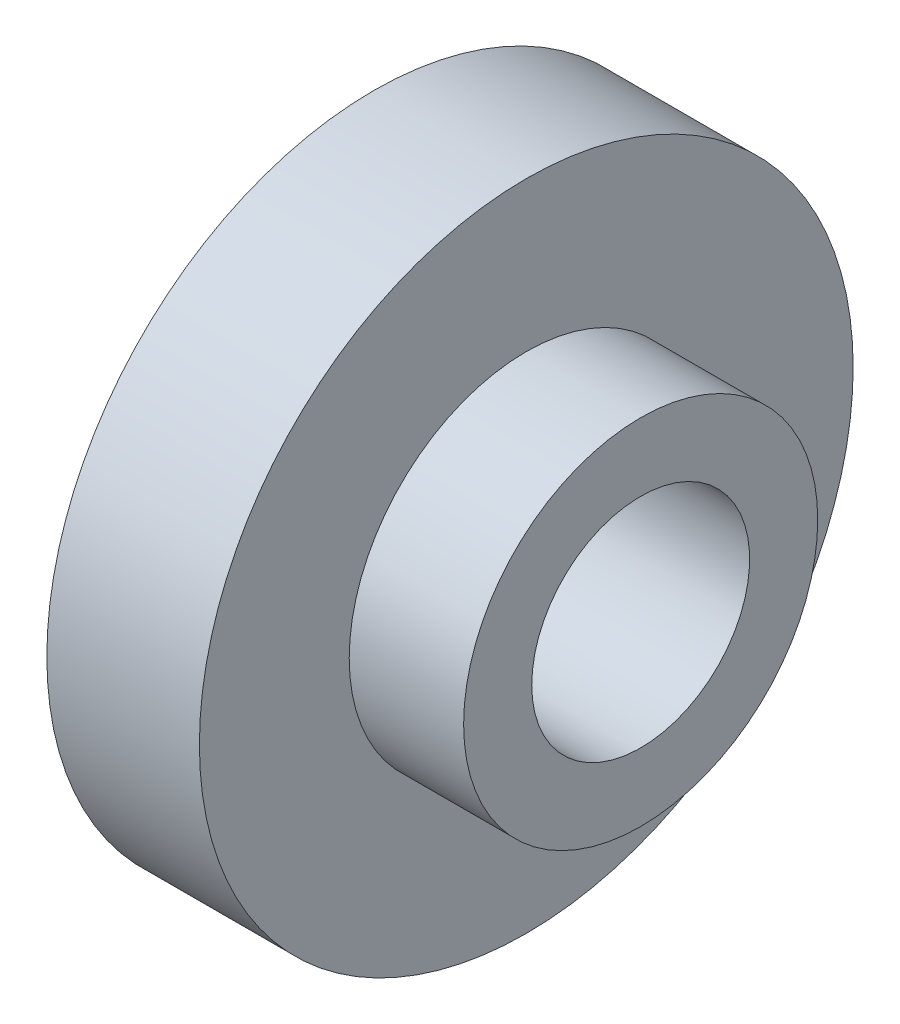
ISO-10303-21;
HEADER;
FILE_DESCRIPTION(('STEP AP214'),'2;1');
FILE_NAME('part.step','',(''),(''),'','','');
FILE_SCHEMA(('AUTOMOTIVE_DESIGN { 1 0 10303 214 1 1 1 1 }'));
ENDSEC;
DATA;
#1=APPLICATION_CONTEXT('core data for automotive mechanical design processes');
#2=APPLICATION_PROTOCOL_DEFINITION('international standard','automotive_design',2000,#1);
#3=PRODUCT_CONTEXT('',#1,'mechanical');
#4=PRODUCT('Part','Part','',(#3));
#5=PRODUCT_RELATED_PRODUCT_CATEGORY('part','',(#4));
#6=PRODUCT_DEFINITION_FORMATION('','',#4);
#7=PRODUCT_DEFINITION_CONTEXT('part definition',#1,'design');
#8=PRODUCT_DEFINITION('design','',#6,#7);
#9=PRODUCT_DEFINITION_SHAPE('','',#8);
#10=(LENGTH_UNIT() NAMED_UNIT(*) SI_UNIT(.MILLI.,.METRE.));
#11=(NAMED_UNIT(*) PLANE_ANGLE_UNIT() SI_UNIT($,.RADIAN.));
#12=(NAMED_UNIT(*) SI_UNIT($,.STERADIAN.) SOLID_ANGLE_UNIT());
#13=UNCERTAINTY_MEASURE_WITH_UNIT(LENGTH_MEASURE(1.E-05),#10,'distance_accuracy_value','');
#14=(GEOMETRIC_REPRESENTATION_CONTEXT(3) GLOBAL_UNCERTAINTY_ASSIGNED_CONTEXT((#13)) GLOBAL_UNIT_ASSIGNED_CONTEXT((#10,
#11,#12)) REPRESENTATION_CONTEXT('',''));
#15=CARTESIAN_POINT('',(0.,0.,0.));
#16=DIRECTION('',(0.,0.,1.));
#17=DIRECTION('',(1.,0.,0.));
#18=AXIS2_PLACEMENT_3D('',#15,#16,#17);
#19=CARTESIAN_POINT('',(0.,0.,0.));
#20=DIRECTION('',(-1.,0.,0.));
#21=DIRECTION('',(0.,0.,1.));
#22=AXIS2_PLACEMENT_3D('',#19,#20,#21);
#23=CYLINDRICAL_SURFACE('',#22,6.);
#24=CARTESIAN_POINT('',(0.,0.,0.));
#25=DIRECTION('',(-1.,0.,0.));
#26=DIRECTION('',(0.,0.,1.));
#27=AXIS2_PLACEMENT_3D('',#24,#25,#26);
#28=CIRCLE('',#27,6.);
#29=CARTESIAN_POINT('',(0.,0.,6.));
#30=VERTEX_POINT('',#29);
#31=EDGE_CURVE('E54',#30,#30,#28,.T.);
#32=ORIENTED_EDGE('',*,*,#31,.F.);
#33=EDGE_LOOP('',(#32));
#34=FACE_BOUND('',#33,.T.);
#35=CARTESIAN_POINT('',(2.8,0.,0.));
#36=DIRECTION('',(-1.,0.,0.));
#37=DIRECTION('',(0.,0.,1.));
#38=AXIS2_PLACEMENT_3D('',#35,#36,#37);
#39=CIRCLE('',#38,6.);
#40=CARTESIAN_POINT('',(2.8,0.,6.));
#41=VERTEX_POINT('',#40);
#42=EDGE_CURVE('E10',#41,#41,#39,.T.);
#43=ORIENTED_EDGE('',*,*,#42,.T.);
#44=EDGE_LOOP('',(#43));
#45=FACE_BOUND('',#44,.T.);
#46=ADVANCED_FACE('F29',(#34,#45),#23,.T.);
#47=CARTESIAN_POINT('',(2.8,6.,0.));
#48=DIRECTION('',(-1.,0.,0.));
#49=DIRECTION('',(0.,0.,1.));
#50=AXIS2_PLACEMENT_3D('',#47,#48,#49);
#51=PLANE('',#50);
#52=ORIENTED_EDGE('',*,*,#42,.F.);
#53=EDGE_LOOP('',(#52));
#54=FACE_BOUND('',#53,.T.);
#55=CARTESIAN_POINT('',(2.8,0.,0.));
#56=DIRECTION('',(-1.,0.,0.));
#57=DIRECTION('',(0.,0.,1.));
#58=AXIS2_PLACEMENT_3D('',#55,#56,#57);
#59=CIRCLE('',#58,3.25);
#60=CARTESIAN_POINT('',(2.8,0.,3.25));
#61=VERTEX_POINT('',#60);
#62=EDGE_CURVE('E35',#61,#61,#59,.T.);
#63=ORIENTED_EDGE('',*,*,#62,.T.);
#64=EDGE_LOOP('',(#63));
#65=FACE_BOUND('',#64,.T.);
#66=ADVANCED_FACE('F61',(#54,#65),#51,.F.);
#67=CARTESIAN_POINT('',(0.,0.,0.));
#68=DIRECTION('',(-1.,0.,0.));
#69=DIRECTION('',(0.,0.,1.));
#70=AXIS2_PLACEMENT_3D('',#67,#68,#69);
#71=CYLINDRICAL_SURFACE('',#70,3.25);
#72=ORIENTED_EDGE('',*,*,#62,.F.);
#73=EDGE_LOOP('',(#72));
#74=FACE_BOUND('',#73,.T.);
#75=CARTESIAN_POINT('',(4.9,0.,0.));
#76=DIRECTION('',(-1.,0.,0.));
#77=DIRECTION('',(0.,0.,1.));
#78=AXIS2_PLACEMENT_3D('',#75,#76,#77);
#79=CIRCLE('',#78,3.25);
#80=CARTESIAN_POINT('',(4.9,0.,3.25));
#81=VERTEX_POINT('',#80);
#82=EDGE_CURVE('E39',#81,#81,#79,.T.);
#83=ORIENTED_EDGE('',*,*,#82,.T.);
#84=EDGE_LOOP('',(#83));
#85=FACE_BOUND('',#84,.T.);
#86=ADVANCED_FACE('F65',(#74,#85),#71,.T.);
#87=CARTESIAN_POINT('',(4.9,3.25,0.));
#88=DIRECTION('',(-1.,0.,0.));
#89=DIRECTION('',(0.,0.,1.));
#90=AXIS2_PLACEMENT_3D('',#87,#88,#89);
#91=PLANE('',#90);
#92=ORIENTED_EDGE('',*,*,#82,.F.);
#93=EDGE_LOOP('',(#92));
#94=FACE_BOUND('',#93,.T.);
#95=CARTESIAN_POINT('',(4.9,0.,0.));
#96=DIRECTION('',(-1.,0.,0.));
#97=DIRECTION('',(0.,0.,1.));
#98=AXIS2_PLACEMENT_3D('',#95,#96,#97);
#99=CIRCLE('',#98,2.);
#100=CARTESIAN_POINT('',(4.9,0.,2.));
#101=VERTEX_POINT('',#100);
#102=EDGE_CURVE('E43',#101,#101,#99,.T.);
#103=ORIENTED_EDGE('',*,*,#102,.T.);
#104=EDGE_LOOP('',(#103));
#105=FACE_BOUND('',#104,.T.);
#106=ADVANCED_FACE('F70',(#94,#105),#91,.F.);
#107=CARTESIAN_POINT('',(0.,0.,0.));
#108=DIRECTION('',(-1.,0.,0.));
#109=DIRECTION('',(0.,0.,1.));
#110=AXIS2_PLACEMENT_3D('',#107,#108,#109);
#111=CYLINDRICAL_SURFACE('',#110,2.);
#112=ORIENTED_EDGE('',*,*,#102,.F.);
#113=EDGE_LOOP('',(#112));
#114=FACE_BOUND('',#113,.T.);
#115=CARTESIAN_POINT('',(0.4,0.,0.));
#116=DIRECTION('',(-1.,0.,0.));
#117=DIRECTION('',(0.,0.,1.));
#118=AXIS2_PLACEMENT_3D('',#115,#116,#117);
#119=CIRCLE('',#118,2.);
#120=CARTESIAN_POINT('',(0.4,0.,2.));
#121=VERTEX_POINT('',#120);
#122=EDGE_CURVE('E48',#121,#121,#119,.T.);
#123=ORIENTED_EDGE('',*,*,#122,.T.);
#124=EDGE_LOOP('',(#123));
#125=FACE_BOUND('',#124,.T.);
#126=ADVANCED_FACE('F76',(#114,#125),#111,.F.);
#127=CARTESIAN_POINT('',(0.,0.,0.));
#128=DIRECTION('',(-1.,0.,0.));
#129=DIRECTION('',(0.,0.,1.));
#130=AXIS2_PLACEMENT_3D('',#127,#128,#129);
#131=CONICAL_SURFACE('',#130,2.4,0.785398163397449);
#132=ORIENTED_EDGE('',*,*,#122,.F.);
#133=EDGE_LOOP('',(#132));
#134=FACE_BOUND('',#133,.T.);
#135=CARTESIAN_POINT('',(0.,0.,0.));
#136=DIRECTION('',(-1.,0.,0.));
#137=DIRECTION('',(0.,0.,1.));
#138=AXIS2_PLACEMENT_3D('',#135,#136,#137);
#139=CIRCLE('',#138,2.4);
#140=CARTESIAN_POINT('',(0.,0.,2.4));
#141=VERTEX_POINT('',#140);
#142=EDGE_CURVE('E51',#141,#141,#139,.T.);
#143=ORIENTED_EDGE('',*,*,#142,.T.);
#144=EDGE_LOOP('',(#143));
#145=FACE_BOUND('',#144,.T.);
#146=ADVANCED_FACE('F80',(#134,#145),#131,.F.);
#147=CARTESIAN_POINT('',(0.,2.4,0.));
#148=DIRECTION('',(1.,0.,0.));
#149=DIRECTION('',(0.,0.,-1.));
#150=AXIS2_PLACEMENT_3D('',#147,#148,#149);
#151=PLANE('',#150);
#152=ORIENTED_EDGE('',*,*,#142,.F.);
#153=EDGE_LOOP('',(#152));
#154=FACE_BOUND('',#153,.T.);
#155=ORIENTED_EDGE('',*,*,#31,.T.);
#156=EDGE_LOOP('',(#155));
#157=FACE_BOUND('',#156,.T.);
#158=ADVANCED_FACE('F58',(#154,#157),#151,.F.);
#159=CLOSED_SHELL('',(#46,#66,#86,#106,#126,#146,#158));
#160=MANIFOLD_SOLID_BREP('B2',#159);
#161=ADVANCED_BREP_SHAPE_REPRESENTATION('',(#18,#160),#14);
#162=SHAPE_DEFINITION_REPRESENTATION(#9,#161);
ENDSEC;
END-ISO-10303-21;
